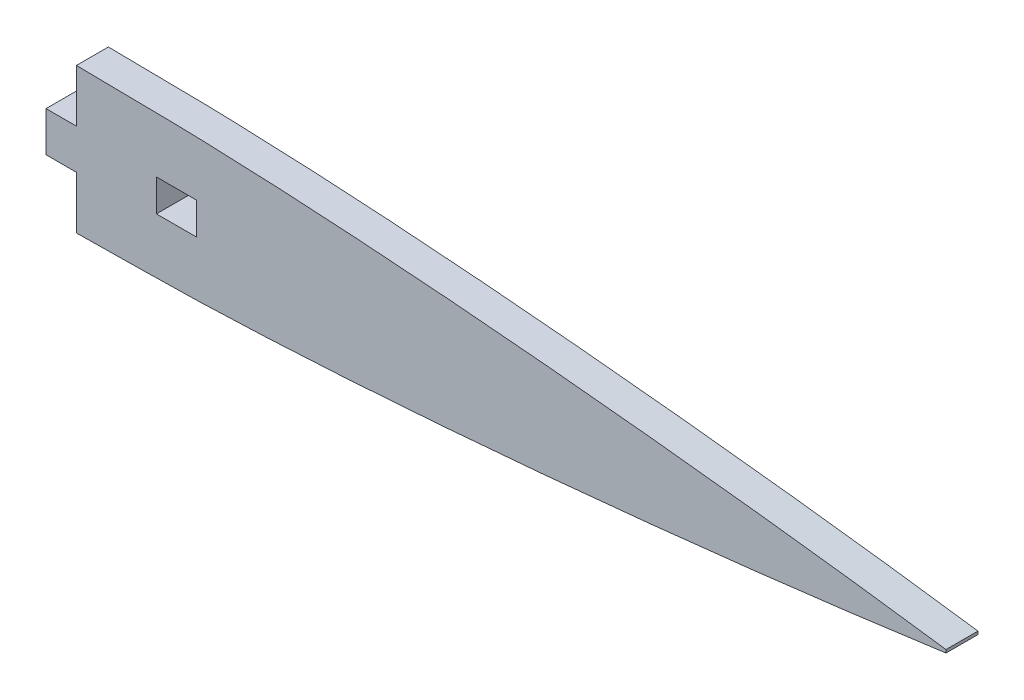
ISO-10303-21;
HEADER;
FILE_DESCRIPTION(('STEP AP214'),'2;1');
FILE_NAME('part.step','',(''),(''),'','','');
FILE_SCHEMA(('AUTOMOTIVE_DESIGN { 1 0 10303 214 1 1 1 1 }'));
ENDSEC;
DATA;
#1=APPLICATION_CONTEXT('core data for automotive mechanical design processes');
#2=APPLICATION_PROTOCOL_DEFINITION('international standard','automotive_design',2000,#1);
#3=PRODUCT_CONTEXT('',#1,'mechanical');
#4=PRODUCT('Part','Part','',(#3));
#5=PRODUCT_RELATED_PRODUCT_CATEGORY('part','',(#4));
#6=PRODUCT_DEFINITION_FORMATION('','',#4);
#7=PRODUCT_DEFINITION_CONTEXT('part definition',#1,'design');
#8=PRODUCT_DEFINITION('design','',#6,#7);
#9=PRODUCT_DEFINITION_SHAPE('','',#8);
#10=(LENGTH_UNIT() NAMED_UNIT(*) SI_UNIT(.MILLI.,.METRE.));
#11=(NAMED_UNIT(*) PLANE_ANGLE_UNIT() SI_UNIT($,.RADIAN.));
#12=(NAMED_UNIT(*) SI_UNIT($,.STERADIAN.) SOLID_ANGLE_UNIT());
#13=UNCERTAINTY_MEASURE_WITH_UNIT(LENGTH_MEASURE(1.E-05),#10,'distance_accuracy_value','');
#14=(GEOMETRIC_REPRESENTATION_CONTEXT(3) GLOBAL_UNCERTAINTY_ASSIGNED_CONTEXT((#13)) GLOBAL_UNIT_ASSIGNED_CONTEXT((#10,
#11,#12)) REPRESENTATION_CONTEXT('',''));
#15=CARTESIAN_POINT('',(0.,0.,0.));
#16=DIRECTION('',(0.,0.,1.));
#17=DIRECTION('',(1.,0.,0.));
#18=AXIS2_PLACEMENT_3D('',#15,#16,#17);
#19=CARTESIAN_POINT('',(47.6250000000004,-11.59002,5.08));
#20=CARTESIAN_POINT('',(49.2125827701925,-11.5732324777364,5.08));
#21=CARTESIAN_POINT('',(52.3242516068237,-11.5299027886453,5.08));
#22=CARTESIAN_POINT('',(58.6097900930823,-11.383526435337,5.08));
#23=CARTESIAN_POINT('',(66.4864740658048,-11.3888941529143,5.08));
#24=CARTESIAN_POINT('',(76.0120994729681,-11.0817698521407,5.08));
#25=CARTESIAN_POINT('',(85.6014114453213,-10.6661113075526,5.08));
#26=CARTESIAN_POINT('',(95.1897052864343,-10.1047193555695,5.08));
#27=CARTESIAN_POINT('',(104.778286224817,-9.44870063716227,5.08));
#28=CARTESIAN_POINT('',(114.303143312242,-8.70475479287128,5.08));
#29=CARTESIAN_POINT('',(123.828345260701,-7.88579446631066,5.08));
#30=CARTESIAN_POINT('',(133.353195337883,-6.9904827378657,5.08));
#31=CARTESIAN_POINT('',(142.87823509018,-6.02990851154123,5.08));
#32=CARTESIAN_POINT('',(152.403404308391,-5.00664790278837,5.08));
#33=CARTESIAN_POINT('',(161.928923416151,-3.92208987219171,5.08));
#34=CARTESIAN_POINT('',(171.454029858232,-2.76806308053822,5.08));
#35=CARTESIAN_POINT('',(180.980468384604,-1.55312333061111,5.08));
#36=CARTESIAN_POINT('',(187.325723566217,-0.677879400907034,5.08));
#37=CARTESIAN_POINT('',(190.5,-0.24003,5.08));
#38=B_SPLINE_CURVE_WITH_KNOTS('',3,(#19,#20,#21,#22,#23,#24,#25,#26,#27,#28,#29,#30,#31,#32,#33,
#34,#35,#36,#37),.UNSPECIFIED.,.F.,.F.,(4,1,1,1,1,1,1,1,1,1,1,1,1,1,1,1,4),(0.632433919786023,
0.644639622012071,0.656358033321701,0.680768176909528,0.70518703148146,0.729619521717807,
0.754557907488244,0.779023813920224,0.803506447849447,0.828005419452442,0.852521438169042,
0.87705400352829,0.901603249022864,0.926170219757915,0.950757129502437,0.975365768770781,1.),.UNSPECIFIED.);
#39=DIRECTION('',(0.,0.,-1.));
#40=VECTOR('',#39,1.);
#41=SURFACE_OF_LINEAR_EXTRUSION('',#38,#40);
#42=CARTESIAN_POINT('',(52.4510000000001,-11.5202484716109,5.08));
#43=VERTEX_POINT('',#42);
#44=CARTESIAN_POINT('',(190.5,-0.24003,5.08));
#45=VERTEX_POINT('',#44);
#46=EDGE_CURVE('E179',#43,#45,#38,.T.);
#47=ORIENTED_EDGE('',*,*,#46,.F.);
#48=DIRECTION('',(0.,0.,-1.));
#49=VECTOR('',#48,1.);
#50=CARTESIAN_POINT('',(52.4510000000001,-11.5202484716109,5.08));
#51=LINE('',#50,#49);
#52=CARTESIAN_POINT('',(52.4510000000001,-11.5202484716109,0.));
#53=VERTEX_POINT('',#52);
#54=EDGE_CURVE('E166',#43,#53,#51,.T.);
#55=ORIENTED_EDGE('',*,*,#54,.T.);
#56=CARTESIAN_POINT('',(47.6250000000004,-11.59002,0.));
#57=CARTESIAN_POINT('',(49.2125827701925,-11.5732324777364,0.));
#58=CARTESIAN_POINT('',(52.3242516068237,-11.5299027886453,0.));
#59=CARTESIAN_POINT('',(58.6097900930823,-11.383526435337,0.));
#60=CARTESIAN_POINT('',(66.4864740658048,-11.3888941529143,0.));
#61=CARTESIAN_POINT('',(76.0120994729681,-11.0817698521407,0.));
#62=CARTESIAN_POINT('',(85.6014114453213,-10.6661113075526,0.));
#63=CARTESIAN_POINT('',(95.1897052864343,-10.1047193555695,0.));
#64=CARTESIAN_POINT('',(104.778286224817,-9.44870063716227,0.));
#65=CARTESIAN_POINT('',(114.303143312242,-8.70475479287128,0.));
#66=CARTESIAN_POINT('',(123.828345260701,-7.88579446631066,0.));
#67=CARTESIAN_POINT('',(133.353195337883,-6.9904827378657,0.));
#68=CARTESIAN_POINT('',(142.87823509018,-6.02990851154123,0.));
#69=CARTESIAN_POINT('',(152.403404308391,-5.00664790278837,0.));
#70=CARTESIAN_POINT('',(161.928923416151,-3.92208987219171,0.));
#71=CARTESIAN_POINT('',(171.454029858232,-2.76806308053822,0.));
#72=CARTESIAN_POINT('',(180.980468384604,-1.55312333061111,0.));
#73=CARTESIAN_POINT('',(187.325723566217,-0.677879400907034,0.));
#74=CARTESIAN_POINT('',(190.5,-0.24003,0.));
#75=B_SPLINE_CURVE_WITH_KNOTS('',3,(#56,#57,#58,#59,#60,#61,#62,#63,#64,#65,#66,#67,#68,#69,#70,
#71,#72,#73,#74),.UNSPECIFIED.,.F.,.F.,(4,1,1,1,1,1,1,1,1,1,1,1,1,1,1,1,4),(0.632433919786023,
0.644639622012071,0.656358033321701,0.680768176909528,0.70518703148146,0.729619521717807,
0.754557907488244,0.779023813920224,0.803506447849447,0.828005419452442,0.852521438169042,
0.87705400352829,0.901603249022864,0.926170219757915,0.950757129502437,0.975365768770781,1.),.UNSPECIFIED.);
#76=CARTESIAN_POINT('',(190.5,-0.24003,0.));
#77=VERTEX_POINT('',#76);
#78=EDGE_CURVE('E161',#53,#77,#75,.T.);
#79=ORIENTED_EDGE('',*,*,#78,.T.);
#80=DIRECTION('',(0.,0.,-1.));
#81=VECTOR('',#80,1.);
#82=CARTESIAN_POINT('',(190.5,-0.24003,5.08));
#83=LINE('',#82,#81);
#84=EDGE_CURVE('E41',#45,#77,#83,.T.);
#85=ORIENTED_EDGE('',*,*,#84,.F.);
#86=EDGE_LOOP('',(#47,#55,#79,#85));
#87=FACE_BOUND('',#86,.T.);
#88=ADVANCED_FACE('F33',(#87),#41,.F.);
#89=CARTESIAN_POINT('',(190.5,0.240029999996026,5.08));
#90=DIRECTION('',(-1.,-6.93802665063333E-13,0.));
#91=DIRECTION('',(6.93802665063333E-13,-1.,0.));
#92=AXIS2_PLACEMENT_3D('',#89,#90,#91);
#93=PLANE('',#92);
#94=DIRECTION('',(-6.93802665063333E-13,1.,0.));
#95=VECTOR('',#94,1.);
#96=CARTESIAN_POINT('',(190.5,0.240029999996026,0.));
#97=LINE('',#96,#95);
#98=CARTESIAN_POINT('',(190.5,0.240029999996025,0.));
#99=VERTEX_POINT('',#98);
#100=EDGE_CURVE('E165',#77,#99,#97,.T.);
#101=ORIENTED_EDGE('',*,*,#100,.T.);
#102=DIRECTION('',(0.,0.,-1.));
#103=VECTOR('',#102,1.);
#104=CARTESIAN_POINT('',(190.5,0.240029999996025,5.08));
#105=LINE('',#104,#103);
#106=CARTESIAN_POINT('',(190.5,0.240029999996025,5.08));
#107=VERTEX_POINT('',#106);
#108=EDGE_CURVE('E148',#107,#99,#105,.T.);
#109=ORIENTED_EDGE('',*,*,#108,.F.);
#110=DIRECTION('',(-6.93802665063333E-13,1.,0.));
#111=VECTOR('',#110,1.);
#112=CARTESIAN_POINT('',(190.5,0.240029999996026,5.08));
#113=LINE('',#112,#111);
#114=EDGE_CURVE('E154',#45,#107,#113,.T.);
#115=ORIENTED_EDGE('',*,*,#114,.F.);
#116=ORIENTED_EDGE('',*,*,#84,.T.);
#117=EDGE_LOOP('',(#101,#109,#115,#116));
#118=FACE_BOUND('',#117,.T.);
#119=ADVANCED_FACE('F184',(#118),#93,.F.);
#120=CARTESIAN_POINT('',(190.5,0.240029999996025,5.08));
#121=CARTESIAN_POINT('',(187.325723566216,0.677879400903148,5.08));
#122=CARTESIAN_POINT('',(180.980468384603,1.5531233306074,5.08));
#123=CARTESIAN_POINT('',(171.454029858232,2.76806308053477,5.08));
#124=CARTESIAN_POINT('',(161.928923416151,3.92208987218853,5.08));
#125=CARTESIAN_POINT('',(152.40340430839,5.00664790278545,5.08));
#126=CARTESIAN_POINT('',(142.87823509018,6.02990851153857,5.08));
#127=CARTESIAN_POINT('',(133.353195337882,6.99048273786332,5.08));
#128=CARTESIAN_POINT('',(123.828345260701,7.88579446630854,5.08));
#129=CARTESIAN_POINT('',(114.303143312241,8.70475479286943,5.08));
#130=CARTESIAN_POINT('',(104.778286224817,9.44870063716068,5.08));
#131=CARTESIAN_POINT('',(95.1897052864343,10.1047193555682,5.08));
#132=CARTESIAN_POINT('',(85.6014114453212,10.6661113075515,5.08));
#133=CARTESIAN_POINT('',(76.0120994729681,11.0817698521399,5.08));
#134=CARTESIAN_POINT('',(66.4864740658047,11.3888941529138,5.08));
#135=CARTESIAN_POINT('',(58.6097900930824,11.3835264353367,5.08));
#136=CARTESIAN_POINT('',(52.3242516068236,11.5299027886451,5.08));
#137=CARTESIAN_POINT('',(49.2125827701922,11.5732324777363,5.08));
#138=CARTESIAN_POINT('',(47.625,11.59002,5.08));
#139=B_SPLINE_CURVE_WITH_KNOTS('',3,(#120,#121,#122,#123,#124,#125,#126,#127,#128,#129,#130,
#131,#132,#133,#134,#135,#136,#137,#138),.UNSPECIFIED.,.F.,.F.,(4,1,1,1,1,1,1,1,1,1,1,1,1,1,1,1,
4),(0.,0.0246342312292194,0.0492428704975633,0.0738297802420855,0.0983967509771365,
0.12294599647171,0.147478561830958,0.171994580547558,0.196493552150553,0.220976186079776,
0.245442092511756,0.270380478282193,0.29481296851854,0.319231823090472,0.343641966678299,
0.355360377987929,0.367566080213977),.UNSPECIFIED.);
#140=DIRECTION('',(0.,0.,-1.));
#141=VECTOR('',#140,1.);
#142=SURFACE_OF_LINEAR_EXTRUSION('',#139,#141);
#143=CARTESIAN_POINT('',(190.5,0.240029999996025,0.));
#144=CARTESIAN_POINT('',(187.325723566216,0.677879400903148,0.));
#145=CARTESIAN_POINT('',(180.980468384603,1.5531233306074,0.));
#146=CARTESIAN_POINT('',(171.454029858232,2.76806308053477,0.));
#147=CARTESIAN_POINT('',(161.928923416151,3.92208987218853,0.));
#148=CARTESIAN_POINT('',(152.40340430839,5.00664790278545,0.));
#149=CARTESIAN_POINT('',(142.87823509018,6.02990851153857,0.));
#150=CARTESIAN_POINT('',(133.353195337882,6.99048273786332,0.));
#151=CARTESIAN_POINT('',(123.828345260701,7.88579446630854,0.));
#152=CARTESIAN_POINT('',(114.303143312241,8.70475479286943,0.));
#153=CARTESIAN_POINT('',(104.778286224817,9.44870063716068,0.));
#154=CARTESIAN_POINT('',(95.1897052864343,10.1047193555682,0.));
#155=CARTESIAN_POINT('',(85.6014114453212,10.6661113075515,0.));
#156=CARTESIAN_POINT('',(76.0120994729681,11.0817698521399,0.));
#157=CARTESIAN_POINT('',(66.4864740658047,11.3888941529138,0.));
#158=CARTESIAN_POINT('',(58.6097900930824,11.3835264353367,0.));
#159=CARTESIAN_POINT('',(52.3242516068236,11.5299027886451,0.));
#160=CARTESIAN_POINT('',(49.2125827701922,11.5732324777363,0.));
#161=CARTESIAN_POINT('',(47.625,11.59002,0.));
#162=B_SPLINE_CURVE_WITH_KNOTS('',3,(#143,#144,#145,#146,#147,#148,#149,#150,#151,#152,#153,
#154,#155,#156,#157,#158,#159,#160,#161),.UNSPECIFIED.,.F.,.F.,(4,1,1,1,1,1,1,1,1,1,1,1,1,1,1,1,
4),(0.,0.0246342312292194,0.0492428704975633,0.0738297802420855,0.0983967509771365,
0.12294599647171,0.147478561830958,0.171994580547558,0.196493552150553,0.220976186079776,
0.245442092511756,0.270380478282193,0.29481296851854,0.319231823090472,0.343641966678299,
0.355360377987929,0.367566080213977),.UNSPECIFIED.);
#163=CARTESIAN_POINT('',(52.450999995362,11.5202484716981,0.));
#164=VERTEX_POINT('',#163);
#165=EDGE_CURVE('E171',#99,#164,#162,.T.);
#166=ORIENTED_EDGE('',*,*,#165,.T.);
#167=DIRECTION('',(0.,0.,-1.));
#168=VECTOR('',#167,1.);
#169=CARTESIAN_POINT('',(52.4510000000001,11.5202484716108,5.08));
#170=LINE('',#169,#168);
#171=CARTESIAN_POINT('',(52.4510000000001,11.5202484716981,5.08));
#172=VERTEX_POINT('',#171);
#173=EDGE_CURVE('E202',#164,#172,#170,.F.);
#174=ORIENTED_EDGE('',*,*,#173,.T.);
#175=EDGE_CURVE('E149',#107,#172,#139,.T.);
#176=ORIENTED_EDGE('',*,*,#175,.F.);
#177=ORIENTED_EDGE('',*,*,#108,.T.);
#178=EDGE_LOOP('',(#166,#174,#176,#177));
#179=FACE_BOUND('',#178,.T.);
#180=ADVANCED_FACE('F200',(#179),#142,.F.);
#181=CARTESIAN_POINT('',(47.625,-11.59002,5.08));
#182=DIRECTION('',(1.,0.,0.));
#183=DIRECTION('',(0.,1.,0.));
#184=AXIS2_PLACEMENT_3D('',#181,#182,#183);
#185=PLANE('',#184);
#186=DIRECTION('',(0.,-1.,0.));
#187=VECTOR('',#186,1.);
#188=CARTESIAN_POINT('',(47.625,-11.59002,0.));
#189=LINE('',#188,#187);
#190=CARTESIAN_POINT('',(47.6250000000001,3.175,0.));
#191=VERTEX_POINT('',#190);
#192=CARTESIAN_POINT('',(47.625,-3.175,0.));
#193=VERTEX_POINT('',#192);
#194=EDGE_CURVE('E141',#191,#193,#189,.T.);
#195=ORIENTED_EDGE('',*,*,#194,.T.);
#196=DIRECTION('',(0.,0.,-1.));
#197=VECTOR('',#196,1.);
#198=CARTESIAN_POINT('',(47.6250000000001,-3.175,5.08));
#199=LINE('',#198,#197);
#200=CARTESIAN_POINT('',(47.6250000000001,-3.175,5.08));
#201=VERTEX_POINT('',#200);
#202=EDGE_CURVE('E124',#201,#193,#199,.T.);
#203=ORIENTED_EDGE('',*,*,#202,.F.);
#204=DIRECTION('',(0.,-1.,0.));
#205=VECTOR('',#204,1.);
#206=CARTESIAN_POINT('',(47.625,-11.59002,5.08));
#207=LINE('',#206,#205);
#208=CARTESIAN_POINT('',(47.6250000000001,3.175,5.08));
#209=VERTEX_POINT('',#208);
#210=EDGE_CURVE('E139',#209,#201,#207,.T.);
#211=ORIENTED_EDGE('',*,*,#210,.F.);
#212=DIRECTION('',(0.,0.,-1.));
#213=VECTOR('',#212,1.);
#214=CARTESIAN_POINT('',(47.6250000000001,3.175,5.08));
#215=LINE('',#214,#213);
#216=EDGE_CURVE('E245',#209,#191,#215,.T.);
#217=ORIENTED_EDGE('',*,*,#216,.T.);
#218=EDGE_LOOP('',(#195,#203,#211,#217));
#219=FACE_BOUND('',#218,.T.);
#220=ADVANCED_FACE('F137',(#219),#185,.F.);
#221=CARTESIAN_POINT('',(119.242553334224,-8.27690317897283,5.08));
#222=DIRECTION('',(0.,0.,-1.));
#223=DIRECTION('',(-1.,0.,0.));
#224=AXIS2_PLACEMENT_3D('',#221,#222,#223);
#225=PLANE('',#224);
#226=DIRECTION('',(-1.,0.,0.));
#227=VECTOR('',#226,1.);
#228=CARTESIAN_POINT('',(65.1510000000001,-2.54,5.08));
#229=LINE('',#228,#227);
#230=CARTESIAN_POINT('',(71.5010000000001,-2.54,5.08));
#231=VERTEX_POINT('',#230);
#232=CARTESIAN_POINT('',(65.1510000000001,-2.54,5.08));
#233=VERTEX_POINT('',#232);
#234=EDGE_CURVE('E216',#231,#233,#229,.T.);
#235=ORIENTED_EDGE('',*,*,#234,.T.);
#236=DIRECTION('',(0.,1.,0.));
#237=VECTOR('',#236,1.);
#238=CARTESIAN_POINT('',(65.1510000000001,-2.54,5.08));
#239=LINE('',#238,#237);
#240=CARTESIAN_POINT('',(65.1510000000001,2.54,5.08));
#241=VERTEX_POINT('',#240);
#242=EDGE_CURVE('E226',#233,#241,#239,.T.);
#243=ORIENTED_EDGE('',*,*,#242,.T.);
#244=DIRECTION('',(1.,0.,0.));
#245=VECTOR('',#244,1.);
#246=CARTESIAN_POINT('',(65.1510000000001,2.54,5.08));
#247=LINE('',#246,#245);
#248=CARTESIAN_POINT('',(71.5010000000001,2.54,5.08));
#249=VERTEX_POINT('',#248);
#250=EDGE_CURVE('E237',#241,#249,#247,.T.);
#251=ORIENTED_EDGE('',*,*,#250,.T.);
#252=DIRECTION('',(0.,-1.,0.));
#253=VECTOR('',#252,1.);
#254=CARTESIAN_POINT('',(71.5010000000001,-2.54,5.08));
#255=LINE('',#254,#253);
#256=EDGE_CURVE('E48',#249,#231,#255,.T.);
#257=ORIENTED_EDGE('',*,*,#256,.T.);
#258=EDGE_LOOP('',(#235,#243,#251,#257));
#259=FACE_BOUND('',#258,.T.);
#260=DIRECTION('',(1.,0.,0.));
#261=VECTOR('',#260,1.);
#262=CARTESIAN_POINT('',(47.6250000000001,-3.175,5.08));
#263=LINE('',#262,#261);
#264=CARTESIAN_POINT('',(52.4510000000001,-3.175,5.08));
#265=VERTEX_POINT('',#264);
#266=EDGE_CURVE('E120',#201,#265,#263,.T.);
#267=ORIENTED_EDGE('',*,*,#266,.T.);
#268=DIRECTION('',(0.,-1.,0.));
#269=VECTOR('',#268,1.);
#270=CARTESIAN_POINT('',(52.4510000000001,-11.59002,5.08));
#271=LINE('',#270,#269);
#272=EDGE_CURVE('E131',#265,#43,#271,.T.);
#273=ORIENTED_EDGE('',*,*,#272,.T.);
#274=ORIENTED_EDGE('',*,*,#46,.T.);
#275=ORIENTED_EDGE('',*,*,#114,.T.);
#276=ORIENTED_EDGE('',*,*,#175,.T.);
#277=DIRECTION('',(0.,-1.,0.));
#278=VECTOR('',#277,1.);
#279=CARTESIAN_POINT('',(52.4510000000001,3.175,5.08));
#280=LINE('',#279,#278);
#281=CARTESIAN_POINT('',(52.4510000000001,3.175,5.08));
#282=VERTEX_POINT('',#281);
#283=EDGE_CURVE('E203',#172,#282,#280,.T.);
#284=ORIENTED_EDGE('',*,*,#283,.T.);
#285=DIRECTION('',(-1.,0.,0.));
#286=VECTOR('',#285,1.);
#287=CARTESIAN_POINT('',(47.6250000000001,3.175,5.08));
#288=LINE('',#287,#286);
#289=EDGE_CURVE('E147',#282,#209,#288,.T.);
#290=ORIENTED_EDGE('',*,*,#289,.T.);
#291=ORIENTED_EDGE('',*,*,#210,.T.);
#292=EDGE_LOOP('',(#267,#273,#274,#275,#276,#284,#290,#291));
#293=FACE_BOUND('',#292,.T.);
#294=ADVANCED_FACE('F144',(#259,#293),#225,.F.);
#295=CARTESIAN_POINT('',(119.242553334224,-8.27690317897283,0.));
#296=DIRECTION('',(0.,0.,-1.));
#297=DIRECTION('',(-1.,0.,0.));
#298=AXIS2_PLACEMENT_3D('',#295,#296,#297);
#299=PLANE('',#298);
#300=DIRECTION('',(0.,-1.,0.));
#301=VECTOR('',#300,1.);
#302=CARTESIAN_POINT('',(52.4510000000001,-11.59002,0.));
#303=LINE('',#302,#301);
#304=CARTESIAN_POINT('',(52.4510000000001,-3.175,0.));
#305=VERTEX_POINT('',#304);
#306=EDGE_CURVE('E132',#305,#53,#303,.T.);
#307=ORIENTED_EDGE('',*,*,#306,.F.);
#308=DIRECTION('',(1.,0.,0.));
#309=VECTOR('',#308,1.);
#310=CARTESIAN_POINT('',(47.6250000000001,-3.175,0.));
#311=LINE('',#310,#309);
#312=EDGE_CURVE('E247',#193,#305,#311,.T.);
#313=ORIENTED_EDGE('',*,*,#312,.F.);
#314=ORIENTED_EDGE('',*,*,#194,.F.);
#315=DIRECTION('',(-1.,0.,0.));
#316=VECTOR('',#315,1.);
#317=CARTESIAN_POINT('',(47.6250000000001,3.175,0.));
#318=LINE('',#317,#316);
#319=CARTESIAN_POINT('',(52.4510000000001,3.175,0.));
#320=VERTEX_POINT('',#319);
#321=EDGE_CURVE('E222',#320,#191,#318,.T.);
#322=ORIENTED_EDGE('',*,*,#321,.F.);
#323=DIRECTION('',(0.,-1.,0.));
#324=VECTOR('',#323,1.);
#325=CARTESIAN_POINT('',(52.4510000000001,-8.27690317897283,0.));
#326=LINE('',#325,#324);
#327=EDGE_CURVE('E11',#164,#320,#326,.T.);
#328=ORIENTED_EDGE('',*,*,#327,.F.);
#329=ORIENTED_EDGE('',*,*,#165,.F.);
#330=ORIENTED_EDGE('',*,*,#100,.F.);
#331=ORIENTED_EDGE('',*,*,#78,.F.);
#332=EDGE_LOOP('',(#307,#313,#314,#322,#328,#329,#330,#331));
#333=FACE_BOUND('',#332,.T.);
#334=DIRECTION('',(0.,1.,0.));
#335=VECTOR('',#334,1.);
#336=CARTESIAN_POINT('',(65.1510000000001,-2.54,0.));
#337=LINE('',#336,#335);
#338=CARTESIAN_POINT('',(65.1510000000001,-2.54,0.));
#339=VERTEX_POINT('',#338);
#340=CARTESIAN_POINT('',(65.1510000000001,2.54,0.));
#341=VERTEX_POINT('',#340);
#342=EDGE_CURVE('E56',#339,#341,#337,.T.);
#343=ORIENTED_EDGE('',*,*,#342,.F.);
#344=DIRECTION('',(-1.,0.,0.));
#345=VECTOR('',#344,1.);
#346=CARTESIAN_POINT('',(65.1510000000001,-2.54,0.));
#347=LINE('',#346,#345);
#348=CARTESIAN_POINT('',(71.5010000000001,-2.54,0.));
#349=VERTEX_POINT('',#348);
#350=EDGE_CURVE('E223',#349,#339,#347,.T.);
#351=ORIENTED_EDGE('',*,*,#350,.F.);
#352=DIRECTION('',(0.,-1.,0.));
#353=VECTOR('',#352,1.);
#354=CARTESIAN_POINT('',(71.5010000000001,-2.54,0.));
#355=LINE('',#354,#353);
#356=CARTESIAN_POINT('',(71.5010000000001,2.54,0.));
#357=VERTEX_POINT('',#356);
#358=EDGE_CURVE('E227',#357,#349,#355,.T.);
#359=ORIENTED_EDGE('',*,*,#358,.F.);
#360=DIRECTION('',(1.,0.,0.));
#361=VECTOR('',#360,1.);
#362=CARTESIAN_POINT('',(65.1510000000001,2.54,0.));
#363=LINE('',#362,#361);
#364=EDGE_CURVE('E230',#341,#357,#363,.T.);
#365=ORIENTED_EDGE('',*,*,#364,.F.);
#366=EDGE_LOOP('',(#343,#351,#359,#365));
#367=FACE_BOUND('',#366,.T.);
#368=ADVANCED_FACE('F194',(#333,#367),#299,.T.);
#369=CARTESIAN_POINT('',(65.1510000000001,-2.54,5.08));
#370=DIRECTION('',(-1.,0.,0.));
#371=DIRECTION('',(0.,0.,1.));
#372=AXIS2_PLACEMENT_3D('',#369,#370,#371);
#373=PLANE('',#372);
#374=ORIENTED_EDGE('',*,*,#342,.T.);
#375=DIRECTION('',(0.,0.,-1.));
#376=VECTOR('',#375,1.);
#377=CARTESIAN_POINT('',(65.1510000000001,2.54,5.08));
#378=LINE('',#377,#376);
#379=EDGE_CURVE('E213',#241,#341,#378,.T.);
#380=ORIENTED_EDGE('',*,*,#379,.F.);
#381=ORIENTED_EDGE('',*,*,#242,.F.);
#382=DIRECTION('',(0.,0.,-1.));
#383=VECTOR('',#382,1.);
#384=CARTESIAN_POINT('',(65.1510000000001,-2.54,5.08));
#385=LINE('',#384,#383);
#386=EDGE_CURVE('E220',#233,#339,#385,.T.);
#387=ORIENTED_EDGE('',*,*,#386,.T.);
#388=EDGE_LOOP('',(#374,#380,#381,#387));
#389=FACE_BOUND('',#388,.T.);
#390=ADVANCED_FACE('F285',(#389),#373,.F.);
#391=CARTESIAN_POINT('',(65.1510000000001,-2.54,5.08));
#392=DIRECTION('',(0.,-1.,0.));
#393=DIRECTION('',(1.,0.,0.));
#394=AXIS2_PLACEMENT_3D('',#391,#392,#393);
#395=PLANE('',#394);
#396=ORIENTED_EDGE('',*,*,#350,.T.);
#397=ORIENTED_EDGE('',*,*,#386,.F.);
#398=ORIENTED_EDGE('',*,*,#234,.F.);
#399=DIRECTION('',(0.,0.,-1.));
#400=VECTOR('',#399,1.);
#401=CARTESIAN_POINT('',(71.5010000000001,-2.54,5.08));
#402=LINE('',#401,#400);
#403=EDGE_CURVE('E218',#231,#349,#402,.T.);
#404=ORIENTED_EDGE('',*,*,#403,.T.);
#405=EDGE_LOOP('',(#396,#397,#398,#404));
#406=FACE_BOUND('',#405,.T.);
#407=ADVANCED_FACE('F290',(#406),#395,.F.);
#408=CARTESIAN_POINT('',(71.5010000000001,-2.54,5.08));
#409=DIRECTION('',(1.,0.,0.));
#410=DIRECTION('',(0.,0.,-1.));
#411=AXIS2_PLACEMENT_3D('',#408,#409,#410);
#412=PLANE('',#411);
#413=ORIENTED_EDGE('',*,*,#358,.T.);
#414=ORIENTED_EDGE('',*,*,#403,.F.);
#415=ORIENTED_EDGE('',*,*,#256,.F.);
#416=DIRECTION('',(0.,0.,-1.));
#417=VECTOR('',#416,1.);
#418=CARTESIAN_POINT('',(71.5010000000001,2.54,5.08));
#419=LINE('',#418,#417);
#420=EDGE_CURVE('E215',#249,#357,#419,.T.);
#421=ORIENTED_EDGE('',*,*,#420,.T.);
#422=EDGE_LOOP('',(#413,#414,#415,#421));
#423=FACE_BOUND('',#422,.T.);
#424=ADVANCED_FACE('F268',(#423),#412,.F.);
#425=CARTESIAN_POINT('',(65.1510000000001,2.54,5.08));
#426=DIRECTION('',(0.,1.,0.));
#427=DIRECTION('',(-1.,0.,0.));
#428=AXIS2_PLACEMENT_3D('',#425,#426,#427);
#429=PLANE('',#428);
#430=ORIENTED_EDGE('',*,*,#364,.T.);
#431=ORIENTED_EDGE('',*,*,#420,.F.);
#432=ORIENTED_EDGE('',*,*,#250,.F.);
#433=ORIENTED_EDGE('',*,*,#379,.T.);
#434=EDGE_LOOP('',(#430,#431,#432,#433));
#435=FACE_BOUND('',#434,.T.);
#436=ADVANCED_FACE('F261',(#435),#429,.F.);
#437=CARTESIAN_POINT('',(52.4510000000001,3.175,5.08));
#438=DIRECTION('',(1.,0.,0.));
#439=DIRECTION('',(0.,0.,-1.));
#440=AXIS2_PLACEMENT_3D('',#437,#438,#439);
#441=PLANE('',#440);
#442=ORIENTED_EDGE('',*,*,#327,.T.);
#443=DIRECTION('',(0.,0.,-1.));
#444=VECTOR('',#443,1.);
#445=CARTESIAN_POINT('',(52.4510000000001,3.175,5.08));
#446=LINE('',#445,#444);
#447=EDGE_CURVE('E242',#282,#320,#446,.T.);
#448=ORIENTED_EDGE('',*,*,#447,.F.);
#449=ORIENTED_EDGE('',*,*,#283,.F.);
#450=ORIENTED_EDGE('',*,*,#173,.F.);
#451=EDGE_LOOP('',(#442,#448,#449,#450));
#452=FACE_BOUND('',#451,.T.);
#453=ADVANCED_FACE('F259',(#452),#441,.F.);
#454=CARTESIAN_POINT('',(47.6250000000001,3.175,5.08));
#455=DIRECTION('',(0.,-1.,0.));
#456=DIRECTION('',(1.,0.,0.));
#457=AXIS2_PLACEMENT_3D('',#454,#455,#456);
#458=PLANE('',#457);
#459=ORIENTED_EDGE('',*,*,#321,.T.);
#460=ORIENTED_EDGE('',*,*,#216,.F.);
#461=ORIENTED_EDGE('',*,*,#289,.F.);
#462=ORIENTED_EDGE('',*,*,#447,.T.);
#463=EDGE_LOOP('',(#459,#460,#461,#462));
#464=FACE_BOUND('',#463,.T.);
#465=ADVANCED_FACE('F257',(#464),#458,.F.);
#466=CARTESIAN_POINT('',(52.4510000000001,-11.59002,5.08));
#467=DIRECTION('',(1.,0.,0.));
#468=DIRECTION('',(0.,0.,-1.));
#469=AXIS2_PLACEMENT_3D('',#466,#467,#468);
#470=PLANE('',#469);
#471=ORIENTED_EDGE('',*,*,#272,.F.);
#472=DIRECTION('',(0.,0.,-1.));
#473=VECTOR('',#472,1.);
#474=CARTESIAN_POINT('',(52.4510000000001,-3.175,5.08));
#475=LINE('',#474,#473);
#476=EDGE_CURVE('E126',#265,#305,#475,.T.);
#477=ORIENTED_EDGE('',*,*,#476,.T.);
#478=ORIENTED_EDGE('',*,*,#306,.T.);
#479=ORIENTED_EDGE('',*,*,#54,.F.);
#480=EDGE_LOOP('',(#471,#477,#478,#479));
#481=FACE_BOUND('',#480,.T.);
#482=ADVANCED_FACE('F255',(#481),#470,.F.);
#483=CARTESIAN_POINT('',(47.6250000000001,-3.175,5.08));
#484=DIRECTION('',(0.,1.,0.));
#485=DIRECTION('',(-1.,0.,0.));
#486=AXIS2_PLACEMENT_3D('',#483,#484,#485);
#487=PLANE('',#486);
#488=ORIENTED_EDGE('',*,*,#312,.T.);
#489=ORIENTED_EDGE('',*,*,#476,.F.);
#490=ORIENTED_EDGE('',*,*,#266,.F.);
#491=ORIENTED_EDGE('',*,*,#202,.T.);
#492=EDGE_LOOP('',(#488,#489,#490,#491));
#493=FACE_BOUND('',#492,.T.);
#494=ADVANCED_FACE('F123',(#493),#487,.F.);
#495=CLOSED_SHELL('',(#88,#119,#180,#220,#294,#368,#390,#407,#424,#436,#453,#465,#482,#494));
#496=MANIFOLD_SOLID_BREP('B2',#495);
#497=ADVANCED_BREP_SHAPE_REPRESENTATION('',(#18,#496),#14);
#498=SHAPE_DEFINITION_REPRESENTATION(#9,#497);
ENDSEC;
END-ISO-10303-21;
